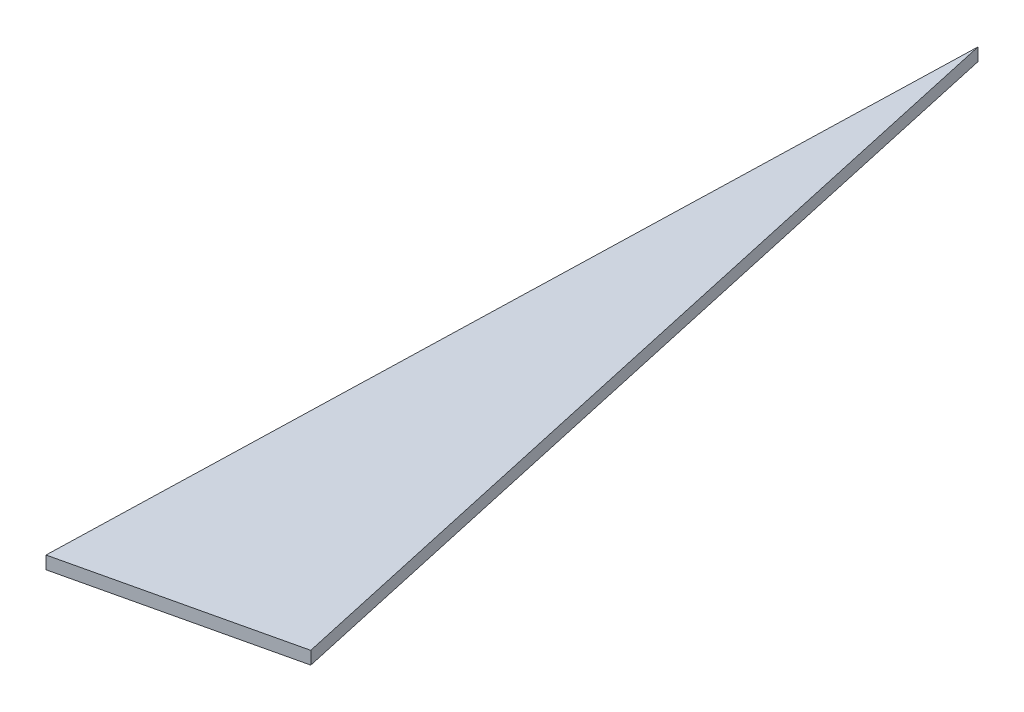
ISO-10303-21;
HEADER;
FILE_DESCRIPTION(('STEP AP214'),'2;1');
FILE_NAME('part.step','',(''),(''),'','','');
FILE_SCHEMA(('AUTOMOTIVE_DESIGN { 1 0 10303 214 1 1 1 1 }'));
ENDSEC;
DATA;
#1=APPLICATION_CONTEXT('core data for automotive mechanical design processes');
#2=APPLICATION_PROTOCOL_DEFINITION('international standard','automotive_design',2000,#1);
#3=PRODUCT_CONTEXT('',#1,'mechanical');
#4=PRODUCT('Part','Part','',(#3));
#5=PRODUCT_RELATED_PRODUCT_CATEGORY('part','',(#4));
#6=PRODUCT_DEFINITION_FORMATION('','',#4);
#7=PRODUCT_DEFINITION_CONTEXT('part definition',#1,'design');
#8=PRODUCT_DEFINITION('design','',#6,#7);
#9=PRODUCT_DEFINITION_SHAPE('','',#8);
#10=(LENGTH_UNIT() NAMED_UNIT(*) SI_UNIT(.MILLI.,.METRE.));
#11=(NAMED_UNIT(*) PLANE_ANGLE_UNIT() SI_UNIT($,.RADIAN.));
#12=(NAMED_UNIT(*) SI_UNIT($,.STERADIAN.) SOLID_ANGLE_UNIT());
#13=UNCERTAINTY_MEASURE_WITH_UNIT(LENGTH_MEASURE(1.E-05),#10,'distance_accuracy_value','');
#14=(GEOMETRIC_REPRESENTATION_CONTEXT(3) GLOBAL_UNCERTAINTY_ASSIGNED_CONTEXT((#13)) GLOBAL_UNIT_ASSIGNED_CONTEXT((#10,
#11,#12)) REPRESENTATION_CONTEXT('',''));
#15=CARTESIAN_POINT('',(0.,0.,0.));
#16=DIRECTION('',(0.,0.,1.));
#17=DIRECTION('',(1.,0.,0.));
#18=AXIS2_PLACEMENT_3D('',#15,#16,#17);
#19=CARTESIAN_POINT('',(0.,2.,0.));
#20=DIRECTION('',(-0.225729198306331,0.,-0.9741900887568));
#21=DIRECTION('',(-0.9741900887568,0.,0.225729198306331));
#22=AXIS2_PLACEMENT_3D('',#19,#20,#21);
#23=PLANE('',#22);
#24=DIRECTION('',(0.974190088756799,0.,-0.225729198306331));
#25=VECTOR('',#24,1.);
#26=CARTESIAN_POINT('',(0.,0.,0.));
#27=LINE('',#26,#25);
#28=CARTESIAN_POINT('',(0.,0.,0.));
#29=VERTEX_POINT('',#28);
#30=CARTESIAN_POINT('',(33.5515302567105,0.,-7.77421174184062));
#31=VERTEX_POINT('',#30);
#32=EDGE_CURVE('E89',#29,#31,#27,.T.);
#33=ORIENTED_EDGE('',*,*,#32,.T.);
#34=DIRECTION('',(0.,-1.,0.));
#35=VECTOR('',#34,1.);
#36=CARTESIAN_POINT('',(33.5515302567105,2.,-7.77421174184062));
#37=LINE('',#36,#35);
#38=CARTESIAN_POINT('',(33.5515302567105,2.,-7.77421174184062));
#39=VERTEX_POINT('',#38);
#40=EDGE_CURVE('E11',#39,#31,#37,.T.);
#41=ORIENTED_EDGE('',*,*,#40,.F.);
#42=DIRECTION('',(0.974190088756799,0.,-0.225729198306331));
#43=VECTOR('',#42,1.);
#44=CARTESIAN_POINT('',(0.,2.,0.));
#45=LINE('',#44,#43);
#46=CARTESIAN_POINT('',(0.,2.,0.));
#47=VERTEX_POINT('',#46);
#48=EDGE_CURVE('E81',#47,#39,#45,.T.);
#49=ORIENTED_EDGE('',*,*,#48,.F.);
#50=DIRECTION('',(0.,-1.,0.));
#51=VECTOR('',#50,1.);
#52=CARTESIAN_POINT('',(0.,2.,0.));
#53=LINE('',#52,#51);
#54=EDGE_CURVE('E90',#47,#29,#53,.T.);
#55=ORIENTED_EDGE('',*,*,#54,.T.);
#56=EDGE_LOOP('',(#33,#41,#49,#55));
#57=FACE_BOUND('',#56,.T.);
#58=ADVANCED_FACE('F39',(#57),#23,.F.);
#59=CARTESIAN_POINT('',(33.5515302567105,2.,-7.77421174184062));
#60=DIRECTION('',(-0.976493047879943,0.,0.215548898030444));
#61=DIRECTION('',(0.215548898030444,0.,0.976493047879943));
#62=AXIS2_PLACEMENT_3D('',#59,#60,#61);
#63=PLANE('',#62);
#64=DIRECTION('',(-0.215548898030444,0.,-0.976493047879943));
#65=VECTOR('',#64,1.);
#66=CARTESIAN_POINT('',(33.5515302567105,0.,-7.77421174184062));
#67=LINE('',#66,#65);
#68=CARTESIAN_POINT('',(4.05214841949725,0.,-141.414149333755));
#69=VERTEX_POINT('',#68);
#70=EDGE_CURVE('E68',#31,#69,#67,.T.);
#71=ORIENTED_EDGE('',*,*,#70,.T.);
#72=DIRECTION('',(0.,-1.,0.));
#73=VECTOR('',#72,1.);
#74=CARTESIAN_POINT('',(4.05214841949725,2.,-141.414149333755));
#75=LINE('',#74,#73);
#76=CARTESIAN_POINT('',(4.05214841949725,2.,-141.414149333755));
#77=VERTEX_POINT('',#76);
#78=EDGE_CURVE('E48',#77,#69,#75,.T.);
#79=ORIENTED_EDGE('',*,*,#78,.F.);
#80=DIRECTION('',(-0.215548898030444,0.,-0.976493047879943));
#81=VECTOR('',#80,1.);
#82=CARTESIAN_POINT('',(33.5515302567105,2.,-7.77421174184062));
#83=LINE('',#82,#81);
#84=EDGE_CURVE('E76',#39,#77,#83,.T.);
#85=ORIENTED_EDGE('',*,*,#84,.F.);
#86=ORIENTED_EDGE('',*,*,#40,.T.);
#87=EDGE_LOOP('',(#71,#79,#85,#86));
#88=FACE_BOUND('',#87,.T.);
#89=ADVANCED_FACE('F77',(#88),#63,.F.);
#90=CARTESIAN_POINT('',(4.05214841949725,2.,-141.414149333755));
#91=DIRECTION('',(0.999589713129301,0.,0.0286427199490692));
#92=DIRECTION('',(0.0286427199490692,0.,-0.999589713129301));
#93=AXIS2_PLACEMENT_3D('',#90,#91,#92);
#94=PLANE('',#93);
#95=DIRECTION('',(-0.0286427199490692,0.,0.999589713129301));
#96=VECTOR('',#95,1.);
#97=CARTESIAN_POINT('',(4.05214841949725,0.,-141.414149333755));
#98=LINE('',#97,#96);
#99=EDGE_CURVE('E73',#69,#29,#98,.T.);
#100=ORIENTED_EDGE('',*,*,#99,.T.);
#101=ORIENTED_EDGE('',*,*,#54,.F.);
#102=DIRECTION('',(-0.0286427199490692,0.,0.999589713129301));
#103=VECTOR('',#102,1.);
#104=CARTESIAN_POINT('',(4.05214841949725,2.,-141.414149333755));
#105=LINE('',#104,#103);
#106=EDGE_CURVE('E56',#77,#47,#105,.T.);
#107=ORIENTED_EDGE('',*,*,#106,.F.);
#108=ORIENTED_EDGE('',*,*,#78,.T.);
#109=EDGE_LOOP('',(#100,#101,#107,#108));
#110=FACE_BOUND('',#109,.T.);
#111=ADVANCED_FACE('F102',(#110),#94,.F.);
#112=CARTESIAN_POINT('',(0.,2.,0.));
#113=DIRECTION('',(0.,1.,0.));
#114=DIRECTION('',(0.,0.,1.));
#115=AXIS2_PLACEMENT_3D('',#112,#113,#114);
#116=PLANE('',#115);
#117=ORIENTED_EDGE('',*,*,#48,.T.);
#118=ORIENTED_EDGE('',*,*,#84,.T.);
#119=ORIENTED_EDGE('',*,*,#106,.T.);
#120=EDGE_LOOP('',(#117,#118,#119));
#121=FACE_BOUND('',#120,.T.);
#122=ADVANCED_FACE('F84',(#121),#116,.T.);
#123=CARTESIAN_POINT('',(0.,0.,0.));
#124=DIRECTION('',(0.,1.,0.));
#125=DIRECTION('',(0.,0.,1.));
#126=AXIS2_PLACEMENT_3D('',#123,#124,#125);
#127=PLANE('',#126);
#128=ORIENTED_EDGE('',*,*,#32,.F.);
#129=ORIENTED_EDGE('',*,*,#99,.F.);
#130=ORIENTED_EDGE('',*,*,#70,.F.);
#131=EDGE_LOOP('',(#128,#129,#130));
#132=FACE_BOUND('',#131,.T.);
#133=ADVANCED_FACE('F103',(#132),#127,.F.);
#134=CLOSED_SHELL('',(#58,#89,#111,#122,#133));
#135=MANIFOLD_SOLID_BREP('B2',#134);
#136=ADVANCED_BREP_SHAPE_REPRESENTATION('',(#18,#135),#14);
#137=SHAPE_DEFINITION_REPRESENTATION(#9,#136);
ENDSEC;
END-ISO-10303-21;
